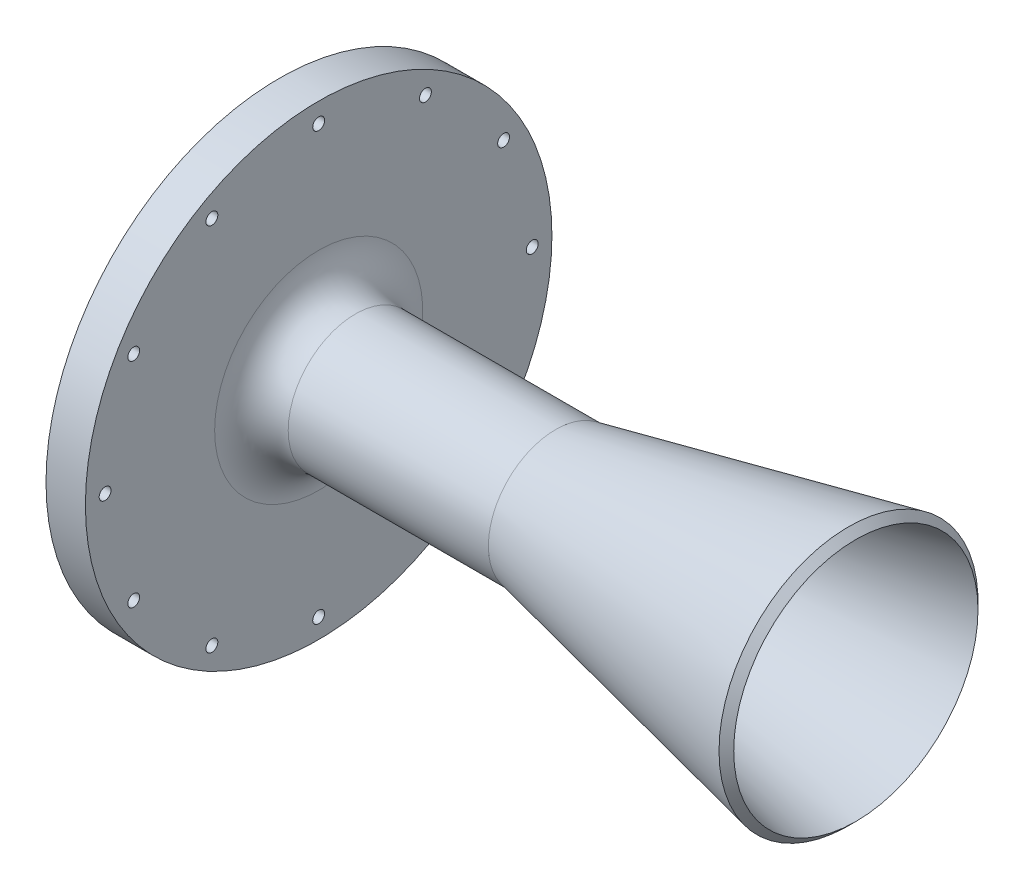
ISO-10303-21;
HEADER;
FILE_DESCRIPTION(('STEP AP214'),'2;1');
FILE_NAME('part.step','',(''),(''),'','','');
FILE_SCHEMA(('AUTOMOTIVE_DESIGN { 1 0 10303 214 1 1 1 1 }'));
ENDSEC;
DATA;
#1=APPLICATION_CONTEXT('core data for automotive mechanical design processes');
#2=APPLICATION_PROTOCOL_DEFINITION('international standard','automotive_design',2000,#1);
#3=PRODUCT_CONTEXT('',#1,'mechanical');
#4=PRODUCT('Part','Part','',(#3));
#5=PRODUCT_RELATED_PRODUCT_CATEGORY('part','',(#4));
#6=PRODUCT_DEFINITION_FORMATION('','',#4);
#7=PRODUCT_DEFINITION_CONTEXT('part definition',#1,'design');
#8=PRODUCT_DEFINITION('design','',#6,#7);
#9=PRODUCT_DEFINITION_SHAPE('','',#8);
#10=(LENGTH_UNIT() NAMED_UNIT(*) SI_UNIT(.MILLI.,.METRE.));
#11=(NAMED_UNIT(*) PLANE_ANGLE_UNIT() SI_UNIT($,.RADIAN.));
#12=(NAMED_UNIT(*) SI_UNIT($,.STERADIAN.) SOLID_ANGLE_UNIT());
#13=UNCERTAINTY_MEASURE_WITH_UNIT(LENGTH_MEASURE(1.E-05),#10,'distance_accuracy_value','');
#14=(GEOMETRIC_REPRESENTATION_CONTEXT(3) GLOBAL_UNCERTAINTY_ASSIGNED_CONTEXT((#13)) GLOBAL_UNIT_ASSIGNED_CONTEXT((#10,
#11,#12)) REPRESENTATION_CONTEXT('',''));
#15=CARTESIAN_POINT('',(0.,0.,0.));
#16=DIRECTION('',(0.,0.,1.));
#17=DIRECTION('',(1.,0.,0.));
#18=AXIS2_PLACEMENT_3D('',#15,#16,#17);
#19=CARTESIAN_POINT('',(0.,20.583496155902,0.));
#20=DIRECTION('',(1.,0.,0.));
#21=DIRECTION('',(0.,0.,-1.));
#22=AXIS2_PLACEMENT_3D('',#19,#20,#21);
#23=PLANE('',#22);
#24=CARTESIAN_POINT('',(0.,0.,0.));
#25=DIRECTION('',(1.,0.,0.));
#26=DIRECTION('',(0.,0.,-1.));
#27=AXIS2_PLACEMENT_3D('',#24,#25,#26);
#28=CIRCLE('',#27,38.1);
#29=CARTESIAN_POINT('',(0.,0.,-38.1));
#30=VERTEX_POINT('',#29);
#31=EDGE_CURVE('E182',#30,#30,#28,.T.);
#32=ORIENTED_EDGE('',*,*,#31,.T.);
#33=EDGE_LOOP('',(#32));
#34=FACE_BOUND('',#33,.T.);
#35=CARTESIAN_POINT('',(0.,-13.3616626129386,49.8664037450867));
#36=DIRECTION('',(-1.,0.,0.));
#37=DIRECTION('',(0.,0.,1.));
#38=AXIS2_PLACEMENT_3D('',#35,#36,#37);
#39=CIRCLE('',#38,2.38125);
#40=CARTESIAN_POINT('',(0.,-13.3616626129386,52.2476537450867));
#41=VERTEX_POINT('',#40);
#42=EDGE_CURVE('E73',#41,#41,#39,.T.);
#43=ORIENTED_EDGE('',*,*,#42,.F.);
#44=EDGE_LOOP('',(#43));
#45=FACE_BOUND('',#44,.T.);
#46=CARTESIAN_POINT('',(0.,13.3616626129382,-49.8664037450868));
#47=DIRECTION('',(-1.,0.,0.));
#48=DIRECTION('',(0.,0.,1.));
#49=AXIS2_PLACEMENT_3D('',#46,#47,#48);
#50=CIRCLE('',#49,2.38125);
#51=CARTESIAN_POINT('',(0.,13.3616626129382,-47.4851537450868));
#52=VERTEX_POINT('',#51);
#53=EDGE_CURVE('E72',#52,#52,#50,.T.);
#54=ORIENTED_EDGE('',*,*,#53,.F.);
#55=EDGE_LOOP('',(#54));
#56=FACE_BOUND('',#55,.T.);
#57=CARTESIAN_POINT('',(0.,-44.7089944830735,-25.81275));
#58=DIRECTION('',(-1.,0.,0.));
#59=DIRECTION('',(0.,0.,1.));
#60=AXIS2_PLACEMENT_3D('',#57,#58,#59);
#61=CIRCLE('',#60,1.43509999999999);
#62=CARTESIAN_POINT('',(0.,-44.7089944830735,-24.37765));
#63=VERTEX_POINT('',#62);
#64=EDGE_CURVE('E91',#63,#63,#61,.T.);
#65=ORIENTED_EDGE('',*,*,#64,.F.);
#66=EDGE_LOOP('',(#65));
#67=FACE_BOUND('',#66,.T.);
#68=CARTESIAN_POINT('',(0.,-25.81275,-44.7089944830735));
#69=DIRECTION('',(-1.,0.,0.));
#70=DIRECTION('',(0.,0.,1.));
#71=AXIS2_PLACEMENT_3D('',#68,#69,#70);
#72=CIRCLE('',#71,1.43509999999999);
#73=CARTESIAN_POINT('',(0.,-25.81275,-43.2738944830735));
#74=VERTEX_POINT('',#73);
#75=EDGE_CURVE('E97',#74,#74,#72,.T.);
#76=ORIENTED_EDGE('',*,*,#75,.F.);
#77=EDGE_LOOP('',(#76));
#78=FACE_BOUND('',#77,.T.);
#79=CARTESIAN_POINT('',(0.,0.,-51.6255));
#80=DIRECTION('',(-1.,0.,0.));
#81=DIRECTION('',(0.,0.,1.));
#82=AXIS2_PLACEMENT_3D('',#79,#80,#81);
#83=CIRCLE('',#82,1.43509999999999);
#84=CARTESIAN_POINT('',(0.,0.,-50.1904));
#85=VERTEX_POINT('',#84);
#86=EDGE_CURVE('E103',#85,#85,#83,.T.);
#87=ORIENTED_EDGE('',*,*,#86,.F.);
#88=EDGE_LOOP('',(#87));
#89=FACE_BOUND('',#88,.T.);
#90=CARTESIAN_POINT('',(0.,25.81275,-44.7089944830735));
#91=DIRECTION('',(-1.,0.,0.));
#92=DIRECTION('',(0.,0.,1.));
#93=AXIS2_PLACEMENT_3D('',#90,#91,#92);
#94=CIRCLE('',#93,1.43509999999999);
#95=CARTESIAN_POINT('',(0.,25.81275,-43.2738944830736));
#96=VERTEX_POINT('',#95);
#97=EDGE_CURVE('E109',#96,#96,#94,.T.);
#98=ORIENTED_EDGE('',*,*,#97,.F.);
#99=EDGE_LOOP('',(#98));
#100=FACE_BOUND('',#99,.T.);
#101=CARTESIAN_POINT('',(0.,44.7089944830735,-25.81275));
#102=DIRECTION('',(-1.,0.,0.));
#103=DIRECTION('',(0.,0.,1.));
#104=AXIS2_PLACEMENT_3D('',#101,#102,#103);
#105=CIRCLE('',#104,1.43509999999999);
#106=CARTESIAN_POINT('',(0.,44.7089944830735,-24.37765));
#107=VERTEX_POINT('',#106);
#108=EDGE_CURVE('E115',#107,#107,#105,.T.);
#109=ORIENTED_EDGE('',*,*,#108,.F.);
#110=EDGE_LOOP('',(#109));
#111=FACE_BOUND('',#110,.T.);
#112=CARTESIAN_POINT('',(0.,51.6255,0.));
#113=DIRECTION('',(-1.,0.,0.));
#114=DIRECTION('',(0.,0.,1.));
#115=AXIS2_PLACEMENT_3D('',#112,#113,#114);
#116=CIRCLE('',#115,1.43509999999999);
#117=CARTESIAN_POINT('',(0.,51.6255,1.43509999999999));
#118=VERTEX_POINT('',#117);
#119=EDGE_CURVE('E121',#118,#118,#116,.T.);
#120=ORIENTED_EDGE('',*,*,#119,.F.);
#121=EDGE_LOOP('',(#120));
#122=FACE_BOUND('',#121,.T.);
#123=CARTESIAN_POINT('',(0.,44.7089944830736,25.81275));
#124=DIRECTION('',(-1.,0.,0.));
#125=DIRECTION('',(0.,0.,1.));
#126=AXIS2_PLACEMENT_3D('',#123,#124,#125);
#127=CIRCLE('',#126,1.43509999999999);
#128=CARTESIAN_POINT('',(0.,44.7089944830736,27.24785));
#129=VERTEX_POINT('',#128);
#130=EDGE_CURVE('E127',#129,#129,#127,.T.);
#131=ORIENTED_EDGE('',*,*,#130,.F.);
#132=EDGE_LOOP('',(#131));
#133=FACE_BOUND('',#132,.T.);
#134=CARTESIAN_POINT('',(0.,25.81275,44.7089944830735));
#135=DIRECTION('',(-1.,0.,0.));
#136=DIRECTION('',(0.,0.,1.));
#137=AXIS2_PLACEMENT_3D('',#134,#135,#136);
#138=CIRCLE('',#137,1.43509999999999);
#139=CARTESIAN_POINT('',(0.,25.81275,46.1440944830735));
#140=VERTEX_POINT('',#139);
#141=EDGE_CURVE('E133',#140,#140,#138,.T.);
#142=ORIENTED_EDGE('',*,*,#141,.F.);
#143=EDGE_LOOP('',(#142));
#144=FACE_BOUND('',#143,.T.);
#145=CARTESIAN_POINT('',(0.,0.,51.6255));
#146=DIRECTION('',(-1.,0.,0.));
#147=DIRECTION('',(0.,0.,1.));
#148=AXIS2_PLACEMENT_3D('',#145,#146,#147);
#149=CIRCLE('',#148,1.43509999999999);
#150=CARTESIAN_POINT('',(0.,0.,53.0606));
#151=VERTEX_POINT('',#150);
#152=EDGE_CURVE('E139',#151,#151,#149,.T.);
#153=ORIENTED_EDGE('',*,*,#152,.F.);
#154=EDGE_LOOP('',(#153));
#155=FACE_BOUND('',#154,.T.);
#156=CARTESIAN_POINT('',(0.,-25.81275,44.7089944830736));
#157=DIRECTION('',(-1.,0.,0.));
#158=DIRECTION('',(0.,0.,1.));
#159=AXIS2_PLACEMENT_3D('',#156,#157,#158);
#160=CIRCLE('',#159,1.43509999999999);
#161=CARTESIAN_POINT('',(0.,-25.81275,46.1440944830736));
#162=VERTEX_POINT('',#161);
#163=EDGE_CURVE('E145',#162,#162,#160,.T.);
#164=ORIENTED_EDGE('',*,*,#163,.F.);
#165=EDGE_LOOP('',(#164));
#166=FACE_BOUND('',#165,.T.);
#167=CARTESIAN_POINT('',(0.,-44.7089944830735,25.81275));
#168=DIRECTION('',(-1.,0.,0.));
#169=DIRECTION('',(0.,0.,1.));
#170=AXIS2_PLACEMENT_3D('',#167,#168,#169);
#171=CIRCLE('',#170,1.43509999999999);
#172=CARTESIAN_POINT('',(0.,-44.7089944830735,27.24785));
#173=VERTEX_POINT('',#172);
#174=EDGE_CURVE('E151',#173,#173,#171,.T.);
#175=ORIENTED_EDGE('',*,*,#174,.F.);
#176=EDGE_LOOP('',(#175));
#177=FACE_BOUND('',#176,.T.);
#178=CARTESIAN_POINT('',(0.,0.,0.));
#179=DIRECTION('',(-1.,0.,0.));
#180=DIRECTION('',(0.,0.,1.));
#181=AXIS2_PLACEMENT_3D('',#178,#179,#180);
#182=CIRCLE('',#181,56.388);
#183=CARTESIAN_POINT('',(0.,0.,56.388));
#184=VERTEX_POINT('',#183);
#185=EDGE_CURVE('E163',#184,#184,#182,.T.);
#186=ORIENTED_EDGE('',*,*,#185,.T.);
#187=EDGE_LOOP('',(#186));
#188=FACE_BOUND('',#187,.T.);
#189=CARTESIAN_POINT('',(0.,-51.6255,0.));
#190=DIRECTION('',(-1.,0.,0.));
#191=DIRECTION('',(0.,0.,1.));
#192=AXIS2_PLACEMENT_3D('',#189,#190,#191);
#193=CIRCLE('',#192,1.43509999999999);
#194=CARTESIAN_POINT('',(0.,-51.6255,1.43509999999999));
#195=VERTEX_POINT('',#194);
#196=EDGE_CURVE('E85',#195,#195,#193,.T.);
#197=ORIENTED_EDGE('',*,*,#196,.F.);
#198=EDGE_LOOP('',(#197));
#199=FACE_BOUND('',#198,.T.);
#200=ADVANCED_FACE('F48',(#34,#45,#56,#67,#78,#89,#100,#111,#122,#133,#144,#155,#166,#177,#188,
#199),#23,.F.);
#201=CARTESIAN_POINT('',(60.325,0.,0.));
#202=DIRECTION('',(1.,0.,0.));
#203=DIRECTION('',(0.,0.,-1.));
#204=AXIS2_PLACEMENT_3D('',#201,#202,#203);
#205=CONICAL_SURFACE('',#204,12.7207818181818,0.20943951023932);
#206=CARTESIAN_POINT('',(139.384584692517,0.,0.));
#207=DIRECTION('',(1.,0.,0.));
#208=DIRECTION('',(0.,0.,-1.));
#209=AXIS2_PLACEMENT_3D('',#206,#207,#208);
#210=CIRCLE('',#209,29.5254153074831);
#211=CARTESIAN_POINT('',(139.384584692517,0.,-29.5254153074831));
#212=VERTEX_POINT('',#211);
#213=EDGE_CURVE('E13',#212,#212,#210,.T.);
#214=ORIENTED_EDGE('',*,*,#213,.T.);
#215=EDGE_LOOP('',(#214));
#216=FACE_BOUND('',#215,.T.);
#217=CARTESIAN_POINT('',(60.325,0.,0.));
#218=DIRECTION('',(-1.,0.,0.));
#219=DIRECTION('',(0.,0.,1.));
#220=AXIS2_PLACEMENT_3D('',#217,#218,#219);
#221=CIRCLE('',#220,12.7207818181818);
#222=CARTESIAN_POINT('',(60.325,0.,12.7207818181818));
#223=VERTEX_POINT('',#222);
#224=EDGE_CURVE('E172',#223,#223,#221,.T.);
#225=ORIENTED_EDGE('',*,*,#224,.T.);
#226=EDGE_LOOP('',(#225));
#227=FACE_BOUND('',#226,.T.);
#228=ADVANCED_FACE('F200',(#216,#227),#205,.F.);
#229=CARTESIAN_POINT('',(60.325,12.7207818181818,0.));
#230=DIRECTION('',(1.,0.,0.));
#231=DIRECTION('',(0.,0.,-1.));
#232=AXIS2_PLACEMENT_3D('',#229,#230,#231);
#233=PLANE('',#232);
#234=ORIENTED_EDGE('',*,*,#224,.F.);
#235=EDGE_LOOP('',(#234));
#236=FACE_BOUND('',#235,.T.);
#237=CARTESIAN_POINT('',(60.325,0.,0.));
#238=DIRECTION('',(-1.,0.,0.));
#239=DIRECTION('',(0.,0.,1.));
#240=AXIS2_PLACEMENT_3D('',#237,#238,#239);
#241=CIRCLE('',#240,14.351);
#242=CARTESIAN_POINT('',(60.325,0.,14.351));
#243=VERTEX_POINT('',#242);
#244=EDGE_CURVE('E169',#243,#243,#241,.T.);
#245=ORIENTED_EDGE('',*,*,#244,.T.);
#246=EDGE_LOOP('',(#245));
#247=FACE_BOUND('',#246,.T.);
#248=ADVANCED_FACE('F206',(#236,#247),#233,.F.);
#249=CARTESIAN_POINT('',(0.,0.,0.));
#250=DIRECTION('',(-1.,0.,0.));
#251=DIRECTION('',(0.,0.,1.));
#252=AXIS2_PLACEMENT_3D('',#249,#250,#251);
#253=CYLINDRICAL_SURFACE('',#252,14.351);
#254=ORIENTED_EDGE('',*,*,#244,.F.);
#255=EDGE_LOOP('',(#254));
#256=FACE_BOUND('',#255,.T.);
#257=CARTESIAN_POINT('',(10.795,0.,0.));
#258=DIRECTION('',(-1.,0.,0.));
#259=DIRECTION('',(0.,0.,1.));
#260=AXIS2_PLACEMENT_3D('',#257,#258,#259);
#261=CIRCLE('',#260,14.351);
#262=CARTESIAN_POINT('',(10.795,0.,14.351));
#263=VERTEX_POINT('',#262);
#264=EDGE_CURVE('E166',#263,#263,#261,.T.);
#265=ORIENTED_EDGE('',*,*,#264,.T.);
#266=EDGE_LOOP('',(#265));
#267=FACE_BOUND('',#266,.T.);
#268=ADVANCED_FACE('F218',(#256,#267),#253,.F.);
#269=CARTESIAN_POINT('',(0.,0.,0.));
#270=DIRECTION('',(-1.,0.,0.));
#271=DIRECTION('',(0.,0.,1.));
#272=AXIS2_PLACEMENT_3D('',#269,#270,#271);
#273=CONICAL_SURFACE('',#272,20.583496155902,0.5235987755983);
#274=CARTESIAN_POINT('',(1.61402236879913,0.,0.));
#275=DIRECTION('',(-1.,0.,0.));
#276=DIRECTION('',(0.,0.,1.));
#277=AXIS2_PLACEMENT_3D('',#274,#275,#276);
#278=CIRCLE('',#277,19.6516399067978);
#279=CARTESIAN_POINT('',(1.61402236879913,0.,19.6516399067978));
#280=VERTEX_POINT('',#279);
#281=EDGE_CURVE('E79',#280,#280,#278,.T.);
#282=ORIENTED_EDGE('',*,*,#281,.T.);
#283=EDGE_LOOP('',(#282));
#284=FACE_BOUND('',#283,.T.);
#285=ORIENTED_EDGE('',*,*,#264,.F.);
#286=EDGE_LOOP('',(#285));
#287=FACE_BOUND('',#286,.T.);
#288=ADVANCED_FACE('F215',(#284,#287),#273,.F.);
#289=CARTESIAN_POINT('',(0.,0.,0.));
#290=DIRECTION('',(-1.,0.,0.));
#291=DIRECTION('',(0.,0.,1.));
#292=AXIS2_PLACEMENT_3D('',#289,#290,#291);
#293=CYLINDRICAL_SURFACE('',#292,56.388);
#294=ORIENTED_EDGE('',*,*,#185,.F.);
#295=EDGE_LOOP('',(#294));
#296=FACE_BOUND('',#295,.T.);
#297=CARTESIAN_POINT('',(9.525,0.,0.));
#298=DIRECTION('',(-1.,0.,0.));
#299=DIRECTION('',(0.,0.,1.));
#300=AXIS2_PLACEMENT_3D('',#297,#298,#299);
#301=CIRCLE('',#300,56.388);
#302=CARTESIAN_POINT('',(9.525,0.,56.388));
#303=VERTEX_POINT('',#302);
#304=EDGE_CURVE('E160',#303,#303,#301,.T.);
#305=ORIENTED_EDGE('',*,*,#304,.T.);
#306=EDGE_LOOP('',(#305));
#307=FACE_BOUND('',#306,.T.);
#308=ADVANCED_FACE('F213',(#296,#307),#293,.T.);
#309=CARTESIAN_POINT('',(9.525,56.388,0.));
#310=DIRECTION('',(-1.,0.,0.));
#311=DIRECTION('',(0.,0.,1.));
#312=AXIS2_PLACEMENT_3D('',#309,#310,#311);
#313=PLANE('',#312);
#314=CARTESIAN_POINT('',(9.525,0.,0.));
#315=DIRECTION('',(-1.,0.,0.));
#316=DIRECTION('',(0.,0.,1.));
#317=AXIS2_PLACEMENT_3D('',#314,#315,#316);
#318=CIRCLE('',#317,25.146);
#319=CARTESIAN_POINT('',(9.525,0.,25.146));
#320=VERTEX_POINT('',#319);
#321=EDGE_CURVE('E175',#320,#320,#318,.T.);
#322=ORIENTED_EDGE('',*,*,#321,.T.);
#323=EDGE_LOOP('',(#322));
#324=FACE_BOUND('',#323,.T.);
#325=CARTESIAN_POINT('',(9.525,-51.6255,0.));
#326=DIRECTION('',(-1.,0.,0.));
#327=DIRECTION('',(0.,0.,1.));
#328=AXIS2_PLACEMENT_3D('',#325,#326,#327);
#329=CIRCLE('',#328,1.43509999999999);
#330=CARTESIAN_POINT('',(9.525,-51.6255,1.43509999999999));
#331=VERTEX_POINT('',#330);
#332=EDGE_CURVE('E88',#331,#331,#329,.T.);
#333=ORIENTED_EDGE('',*,*,#332,.T.);
#334=EDGE_LOOP('',(#333));
#335=FACE_BOUND('',#334,.T.);
#336=CARTESIAN_POINT('',(9.525,-44.7089944830735,-25.81275));
#337=DIRECTION('',(-1.,0.,0.));
#338=DIRECTION('',(0.,0.,1.));
#339=AXIS2_PLACEMENT_3D('',#336,#337,#338);
#340=CIRCLE('',#339,1.43509999999999);
#341=CARTESIAN_POINT('',(9.525,-44.7089944830735,-24.37765));
#342=VERTEX_POINT('',#341);
#343=EDGE_CURVE('E94',#342,#342,#340,.T.);
#344=ORIENTED_EDGE('',*,*,#343,.T.);
#345=EDGE_LOOP('',(#344));
#346=FACE_BOUND('',#345,.T.);
#347=CARTESIAN_POINT('',(9.525,-25.81275,-44.7089944830735));
#348=DIRECTION('',(-1.,0.,0.));
#349=DIRECTION('',(0.,0.,1.));
#350=AXIS2_PLACEMENT_3D('',#347,#348,#349);
#351=CIRCLE('',#350,1.43509999999999);
#352=CARTESIAN_POINT('',(9.525,-25.81275,-43.2738944830735));
#353=VERTEX_POINT('',#352);
#354=EDGE_CURVE('E100',#353,#353,#351,.T.);
#355=ORIENTED_EDGE('',*,*,#354,.T.);
#356=EDGE_LOOP('',(#355));
#357=FACE_BOUND('',#356,.T.);
#358=CARTESIAN_POINT('',(9.525,0.,-51.6255));
#359=DIRECTION('',(-1.,0.,0.));
#360=DIRECTION('',(0.,0.,1.));
#361=AXIS2_PLACEMENT_3D('',#358,#359,#360);
#362=CIRCLE('',#361,1.43509999999999);
#363=CARTESIAN_POINT('',(9.525,0.,-50.1904));
#364=VERTEX_POINT('',#363);
#365=EDGE_CURVE('E106',#364,#364,#362,.T.);
#366=ORIENTED_EDGE('',*,*,#365,.T.);
#367=EDGE_LOOP('',(#366));
#368=FACE_BOUND('',#367,.T.);
#369=CARTESIAN_POINT('',(9.525,25.81275,-44.7089944830735));
#370=DIRECTION('',(-1.,0.,0.));
#371=DIRECTION('',(0.,0.,1.));
#372=AXIS2_PLACEMENT_3D('',#369,#370,#371);
#373=CIRCLE('',#372,1.43509999999999);
#374=CARTESIAN_POINT('',(9.525,25.81275,-43.2738944830736));
#375=VERTEX_POINT('',#374);
#376=EDGE_CURVE('E112',#375,#375,#373,.T.);
#377=ORIENTED_EDGE('',*,*,#376,.T.);
#378=EDGE_LOOP('',(#377));
#379=FACE_BOUND('',#378,.T.);
#380=CARTESIAN_POINT('',(9.525,44.7089944830735,-25.81275));
#381=DIRECTION('',(-1.,0.,0.));
#382=DIRECTION('',(0.,0.,1.));
#383=AXIS2_PLACEMENT_3D('',#380,#381,#382);
#384=CIRCLE('',#383,1.43509999999999);
#385=CARTESIAN_POINT('',(9.525,44.7089944830735,-24.37765));
#386=VERTEX_POINT('',#385);
#387=EDGE_CURVE('E118',#386,#386,#384,.T.);
#388=ORIENTED_EDGE('',*,*,#387,.T.);
#389=EDGE_LOOP('',(#388));
#390=FACE_BOUND('',#389,.T.);
#391=CARTESIAN_POINT('',(9.525,51.6255,0.));
#392=DIRECTION('',(-1.,0.,0.));
#393=DIRECTION('',(0.,0.,1.));
#394=AXIS2_PLACEMENT_3D('',#391,#392,#393);
#395=CIRCLE('',#394,1.43509999999999);
#396=CARTESIAN_POINT('',(9.525,51.6255,1.43509999999999));
#397=VERTEX_POINT('',#396);
#398=EDGE_CURVE('E124',#397,#397,#395,.T.);
#399=ORIENTED_EDGE('',*,*,#398,.T.);
#400=EDGE_LOOP('',(#399));
#401=FACE_BOUND('',#400,.T.);
#402=CARTESIAN_POINT('',(9.525,44.7089944830736,25.81275));
#403=DIRECTION('',(-1.,0.,0.));
#404=DIRECTION('',(0.,0.,1.));
#405=AXIS2_PLACEMENT_3D('',#402,#403,#404);
#406=CIRCLE('',#405,1.43509999999999);
#407=CARTESIAN_POINT('',(9.525,44.7089944830736,27.24785));
#408=VERTEX_POINT('',#407);
#409=EDGE_CURVE('E130',#408,#408,#406,.T.);
#410=ORIENTED_EDGE('',*,*,#409,.T.);
#411=EDGE_LOOP('',(#410));
#412=FACE_BOUND('',#411,.T.);
#413=CARTESIAN_POINT('',(9.525,25.81275,44.7089944830735));
#414=DIRECTION('',(-1.,0.,0.));
#415=DIRECTION('',(0.,0.,1.));
#416=AXIS2_PLACEMENT_3D('',#413,#414,#415);
#417=CIRCLE('',#416,1.43509999999999);
#418=CARTESIAN_POINT('',(9.525,25.81275,46.1440944830735));
#419=VERTEX_POINT('',#418);
#420=EDGE_CURVE('E136',#419,#419,#417,.T.);
#421=ORIENTED_EDGE('',*,*,#420,.T.);
#422=EDGE_LOOP('',(#421));
#423=FACE_BOUND('',#422,.T.);
#424=CARTESIAN_POINT('',(9.525,0.,51.6255));
#425=DIRECTION('',(-1.,0.,0.));
#426=DIRECTION('',(0.,0.,1.));
#427=AXIS2_PLACEMENT_3D('',#424,#425,#426);
#428=CIRCLE('',#427,1.43509999999999);
#429=CARTESIAN_POINT('',(9.525,0.,53.0606));
#430=VERTEX_POINT('',#429);
#431=EDGE_CURVE('E142',#430,#430,#428,.T.);
#432=ORIENTED_EDGE('',*,*,#431,.T.);
#433=EDGE_LOOP('',(#432));
#434=FACE_BOUND('',#433,.T.);
#435=CARTESIAN_POINT('',(9.525,-25.81275,44.7089944830736));
#436=DIRECTION('',(-1.,0.,0.));
#437=DIRECTION('',(0.,0.,1.));
#438=AXIS2_PLACEMENT_3D('',#435,#436,#437);
#439=CIRCLE('',#438,1.43509999999999);
#440=CARTESIAN_POINT('',(9.525,-25.81275,46.1440944830736));
#441=VERTEX_POINT('',#440);
#442=EDGE_CURVE('E148',#441,#441,#439,.T.);
#443=ORIENTED_EDGE('',*,*,#442,.T.);
#444=EDGE_LOOP('',(#443));
#445=FACE_BOUND('',#444,.T.);
#446=CARTESIAN_POINT('',(9.525,-44.7089944830735,25.81275));
#447=DIRECTION('',(-1.,0.,0.));
#448=DIRECTION('',(0.,0.,1.));
#449=AXIS2_PLACEMENT_3D('',#446,#447,#448);
#450=CIRCLE('',#449,1.43509999999999);
#451=CARTESIAN_POINT('',(9.525,-44.7089944830735,27.24785));
#452=VERTEX_POINT('',#451);
#453=EDGE_CURVE('E154',#452,#452,#450,.T.);
#454=ORIENTED_EDGE('',*,*,#453,.T.);
#455=EDGE_LOOP('',(#454));
#456=FACE_BOUND('',#455,.T.);
#457=ORIENTED_EDGE('',*,*,#304,.F.);
#458=EDGE_LOOP('',(#457));
#459=FACE_BOUND('',#458,.T.);
#460=ADVANCED_FACE('F235',(#324,#335,#346,#357,#368,#379,#390,#401,#412,#423,#434,#445,#456,
#459),#313,.F.);
#461=CARTESIAN_POINT('',(0.,0.,0.));
#462=DIRECTION('',(-1.,0.,0.));
#463=DIRECTION('',(0.,0.,1.));
#464=AXIS2_PLACEMENT_3D('',#461,#462,#463);
#465=CYLINDRICAL_SURFACE('',#464,16.256);
#466=CARTESIAN_POINT('',(18.415,0.,0.));
#467=DIRECTION('',(-1.,0.,0.));
#468=DIRECTION('',(0.,0.,1.));
#469=AXIS2_PLACEMENT_3D('',#466,#467,#468);
#470=CIRCLE('',#469,16.256);
#471=CARTESIAN_POINT('',(18.415,0.,16.256));
#472=VERTEX_POINT('',#471);
#473=EDGE_CURVE('E178',#472,#472,#470,.F.);
#474=ORIENTED_EDGE('',*,*,#473,.T.);
#475=EDGE_LOOP('',(#474));
#476=FACE_BOUND('',#475,.T.);
#477=CARTESIAN_POINT('',(66.806461083741,0.,0.));
#478=DIRECTION('',(-1.,0.,0.));
#479=DIRECTION('',(0.,0.,1.));
#480=AXIS2_PLACEMENT_3D('',#477,#478,#479);
#481=CIRCLE('',#480,16.256);
#482=CARTESIAN_POINT('',(66.806461083741,0.,16.256));
#483=VERTEX_POINT('',#482);
#484=EDGE_CURVE('E157',#483,#483,#481,.T.);
#485=ORIENTED_EDGE('',*,*,#484,.T.);
#486=EDGE_LOOP('',(#485));
#487=FACE_BOUND('',#486,.T.);
#488=ADVANCED_FACE('F238',(#476,#487),#465,.T.);
#489=CARTESIAN_POINT('',(139.7,0.,0.));
#490=DIRECTION('',(1.,0.,0.));
#491=DIRECTION('',(0.,0.,-1.));
#492=AXIS2_PLACEMENT_3D('',#489,#490,#491);
#493=CONICAL_SURFACE('',#492,31.75,0.20943951023932);
#494=CARTESIAN_POINT('',(137.605252356639,0.,0.));
#495=DIRECTION('',(-1.,0.,0.));
#496=DIRECTION('',(0.,0.,1.));
#497=AXIS2_PLACEMENT_3D('',#494,#495,#496);
#498=CIRCLE('',#497,31.3047476433608);
#499=CARTESIAN_POINT('',(137.605252356639,0.,31.3047476433608));
#500=VERTEX_POINT('',#499);
#501=EDGE_CURVE('E56',#500,#500,#498,.T.);
#502=ORIENTED_EDGE('',*,*,#501,.T.);
#503=EDGE_LOOP('',(#502));
#504=FACE_BOUND('',#503,.T.);
#505=ORIENTED_EDGE('',*,*,#484,.F.);
#506=EDGE_LOOP('',(#505));
#507=FACE_BOUND('',#506,.T.);
#508=ADVANCED_FACE('F186',(#504,#507),#493,.T.);
#509=CARTESIAN_POINT('',(0.,-44.7089944830735,25.81275));
#510=DIRECTION('',(-1.,0.,0.));
#511=DIRECTION('',(0.,0.,1.));
#512=AXIS2_PLACEMENT_3D('',#509,#510,#511);
#513=CYLINDRICAL_SURFACE('',#512,1.43509999999999);
#514=ORIENTED_EDGE('',*,*,#453,.F.);
#515=EDGE_LOOP('',(#514));
#516=FACE_BOUND('',#515,.T.);
#517=ORIENTED_EDGE('',*,*,#174,.T.);
#518=EDGE_LOOP('',(#517));
#519=FACE_BOUND('',#518,.T.);
#520=ADVANCED_FACE('F324',(#516,#519),#513,.F.);
#521=CARTESIAN_POINT('',(0.,-25.81275,44.7089944830736));
#522=DIRECTION('',(-1.,0.,0.));
#523=DIRECTION('',(0.,0.,1.));
#524=AXIS2_PLACEMENT_3D('',#521,#522,#523);
#525=CYLINDRICAL_SURFACE('',#524,1.43509999999999);
#526=ORIENTED_EDGE('',*,*,#442,.F.);
#527=EDGE_LOOP('',(#526));
#528=FACE_BOUND('',#527,.T.);
#529=ORIENTED_EDGE('',*,*,#163,.T.);
#530=EDGE_LOOP('',(#529));
#531=FACE_BOUND('',#530,.T.);
#532=ADVANCED_FACE('F320',(#528,#531),#525,.F.);
#533=CARTESIAN_POINT('',(0.,0.,51.6255));
#534=DIRECTION('',(-1.,0.,0.));
#535=DIRECTION('',(0.,0.,1.));
#536=AXIS2_PLACEMENT_3D('',#533,#534,#535);
#537=CYLINDRICAL_SURFACE('',#536,1.43509999999999);
#538=ORIENTED_EDGE('',*,*,#431,.F.);
#539=EDGE_LOOP('',(#538));
#540=FACE_BOUND('',#539,.T.);
#541=ORIENTED_EDGE('',*,*,#152,.T.);
#542=EDGE_LOOP('',(#541));
#543=FACE_BOUND('',#542,.T.);
#544=ADVANCED_FACE('F316',(#540,#543),#537,.F.);
#545=CARTESIAN_POINT('',(0.,25.81275,44.7089944830735));
#546=DIRECTION('',(-1.,0.,0.));
#547=DIRECTION('',(0.,0.,1.));
#548=AXIS2_PLACEMENT_3D('',#545,#546,#547);
#549=CYLINDRICAL_SURFACE('',#548,1.43509999999999);
#550=ORIENTED_EDGE('',*,*,#420,.F.);
#551=EDGE_LOOP('',(#550));
#552=FACE_BOUND('',#551,.T.);
#553=ORIENTED_EDGE('',*,*,#141,.T.);
#554=EDGE_LOOP('',(#553));
#555=FACE_BOUND('',#554,.T.);
#556=ADVANCED_FACE('F312',(#552,#555),#549,.F.);
#557=CARTESIAN_POINT('',(0.,44.7089944830736,25.81275));
#558=DIRECTION('',(-1.,0.,0.));
#559=DIRECTION('',(0.,0.,1.));
#560=AXIS2_PLACEMENT_3D('',#557,#558,#559);
#561=CYLINDRICAL_SURFACE('',#560,1.43509999999999);
#562=ORIENTED_EDGE('',*,*,#409,.F.);
#563=EDGE_LOOP('',(#562));
#564=FACE_BOUND('',#563,.T.);
#565=ORIENTED_EDGE('',*,*,#130,.T.);
#566=EDGE_LOOP('',(#565));
#567=FACE_BOUND('',#566,.T.);
#568=ADVANCED_FACE('F308',(#564,#567),#561,.F.);
#569=CARTESIAN_POINT('',(0.,51.6255,0.));
#570=DIRECTION('',(-1.,0.,0.));
#571=DIRECTION('',(0.,0.,1.));
#572=AXIS2_PLACEMENT_3D('',#569,#570,#571);
#573=CYLINDRICAL_SURFACE('',#572,1.43509999999999);
#574=ORIENTED_EDGE('',*,*,#398,.F.);
#575=EDGE_LOOP('',(#574));
#576=FACE_BOUND('',#575,.T.);
#577=ORIENTED_EDGE('',*,*,#119,.T.);
#578=EDGE_LOOP('',(#577));
#579=FACE_BOUND('',#578,.T.);
#580=ADVANCED_FACE('F304',(#576,#579),#573,.F.);
#581=CARTESIAN_POINT('',(0.,44.7089944830735,-25.81275));
#582=DIRECTION('',(-1.,0.,0.));
#583=DIRECTION('',(0.,0.,1.));
#584=AXIS2_PLACEMENT_3D('',#581,#582,#583);
#585=CYLINDRICAL_SURFACE('',#584,1.43509999999999);
#586=ORIENTED_EDGE('',*,*,#387,.F.);
#587=EDGE_LOOP('',(#586));
#588=FACE_BOUND('',#587,.T.);
#589=ORIENTED_EDGE('',*,*,#108,.T.);
#590=EDGE_LOOP('',(#589));
#591=FACE_BOUND('',#590,.T.);
#592=ADVANCED_FACE('F300',(#588,#591),#585,.F.);
#593=CARTESIAN_POINT('',(0.,25.81275,-44.7089944830735));
#594=DIRECTION('',(-1.,0.,0.));
#595=DIRECTION('',(0.,0.,1.));
#596=AXIS2_PLACEMENT_3D('',#593,#594,#595);
#597=CYLINDRICAL_SURFACE('',#596,1.43509999999999);
#598=ORIENTED_EDGE('',*,*,#376,.F.);
#599=EDGE_LOOP('',(#598));
#600=FACE_BOUND('',#599,.T.);
#601=ORIENTED_EDGE('',*,*,#97,.T.);
#602=EDGE_LOOP('',(#601));
#603=FACE_BOUND('',#602,.T.);
#604=ADVANCED_FACE('F296',(#600,#603),#597,.F.);
#605=CARTESIAN_POINT('',(0.,0.,-51.6255));
#606=DIRECTION('',(-1.,0.,0.));
#607=DIRECTION('',(0.,0.,1.));
#608=AXIS2_PLACEMENT_3D('',#605,#606,#607);
#609=CYLINDRICAL_SURFACE('',#608,1.43509999999999);
#610=ORIENTED_EDGE('',*,*,#365,.F.);
#611=EDGE_LOOP('',(#610));
#612=FACE_BOUND('',#611,.T.);
#613=ORIENTED_EDGE('',*,*,#86,.T.);
#614=EDGE_LOOP('',(#613));
#615=FACE_BOUND('',#614,.T.);
#616=ADVANCED_FACE('F292',(#612,#615),#609,.F.);
#617=CARTESIAN_POINT('',(0.,-25.81275,-44.7089944830735));
#618=DIRECTION('',(-1.,0.,0.));
#619=DIRECTION('',(0.,0.,1.));
#620=AXIS2_PLACEMENT_3D('',#617,#618,#619);
#621=CYLINDRICAL_SURFACE('',#620,1.43509999999999);
#622=ORIENTED_EDGE('',*,*,#354,.F.);
#623=EDGE_LOOP('',(#622));
#624=FACE_BOUND('',#623,.T.);
#625=ORIENTED_EDGE('',*,*,#75,.T.);
#626=EDGE_LOOP('',(#625));
#627=FACE_BOUND('',#626,.T.);
#628=ADVANCED_FACE('F285',(#624,#627),#621,.F.);
#629=CARTESIAN_POINT('',(0.,-44.7089944830735,-25.81275));
#630=DIRECTION('',(-1.,0.,0.));
#631=DIRECTION('',(0.,0.,1.));
#632=AXIS2_PLACEMENT_3D('',#629,#630,#631);
#633=CYLINDRICAL_SURFACE('',#632,1.43509999999999);
#634=ORIENTED_EDGE('',*,*,#343,.F.);
#635=EDGE_LOOP('',(#634));
#636=FACE_BOUND('',#635,.T.);
#637=ORIENTED_EDGE('',*,*,#64,.T.);
#638=EDGE_LOOP('',(#637));
#639=FACE_BOUND('',#638,.T.);
#640=ADVANCED_FACE('F277',(#636,#639),#633,.F.);
#641=CARTESIAN_POINT('',(0.,-51.6255,0.));
#642=DIRECTION('',(-1.,0.,0.));
#643=DIRECTION('',(0.,0.,1.));
#644=AXIS2_PLACEMENT_3D('',#641,#642,#643);
#645=CYLINDRICAL_SURFACE('',#644,1.43509999999999);
#646=ORIENTED_EDGE('',*,*,#332,.F.);
#647=EDGE_LOOP('',(#646));
#648=FACE_BOUND('',#647,.T.);
#649=ORIENTED_EDGE('',*,*,#196,.T.);
#650=EDGE_LOOP('',(#649));
#651=FACE_BOUND('',#650,.T.);
#652=ADVANCED_FACE('F274',(#648,#651),#645,.F.);
#653=CARTESIAN_POINT('',(6.35,13.3616626129382,-49.8664037450868));
#654=DIRECTION('',(-1.,0.,0.));
#655=DIRECTION('',(0.,0.,1.));
#656=AXIS2_PLACEMENT_3D('',#653,#654,#655);
#657=CONICAL_SURFACE('',#656,2.38124999999999,1.02974425867665);
#658=CARTESIAN_POINT('',(7.78079934905938,13.3616626129382,-49.8664037450868));
#659=VERTEX_POINT('',#658);
#660=VERTEX_LOOP('',#659);
#661=FACE_BOUND('',#660,.T.);
#662=CARTESIAN_POINT('',(6.35,13.3616626129382,-49.8664037450868));
#663=DIRECTION('',(-1.,0.,0.));
#664=DIRECTION('',(0.,0.,1.));
#665=AXIS2_PLACEMENT_3D('',#662,#663,#664);
#666=CIRCLE('',#665,2.38124999999999);
#667=CARTESIAN_POINT('',(6.35,13.3616626129382,-47.4851537450868));
#668=VERTEX_POINT('',#667);
#669=EDGE_CURVE('E76',#668,#668,#666,.T.);
#670=ORIENTED_EDGE('',*,*,#669,.T.);
#671=EDGE_LOOP('',(#670));
#672=FACE_BOUND('',#671,.T.);
#673=ADVANCED_FACE('F276',(#661,#672),#657,.F.);
#674=CARTESIAN_POINT('',(0.,13.3616626129382,-49.8664037450868));
#675=DIRECTION('',(-1.,0.,0.));
#676=DIRECTION('',(0.,0.,1.));
#677=AXIS2_PLACEMENT_3D('',#674,#675,#676);
#678=CYLINDRICAL_SURFACE('',#677,2.38125);
#679=ORIENTED_EDGE('',*,*,#669,.F.);
#680=EDGE_LOOP('',(#679));
#681=FACE_BOUND('',#680,.T.);
#682=ORIENTED_EDGE('',*,*,#53,.T.);
#683=EDGE_LOOP('',(#682));
#684=FACE_BOUND('',#683,.T.);
#685=ADVANCED_FACE('F66',(#681,#684),#678,.F.);
#686=CARTESIAN_POINT('',(6.35,-13.3616626129386,49.8664037450867));
#687=DIRECTION('',(-1.,0.,0.));
#688=DIRECTION('',(0.,0.,1.));
#689=AXIS2_PLACEMENT_3D('',#686,#687,#688);
#690=CONICAL_SURFACE('',#689,2.38125,1.02974425867665);
#691=CARTESIAN_POINT('',(7.78079934905938,-13.3616626129386,49.8664037450867));
#692=VERTEX_POINT('',#691);
#693=VERTEX_LOOP('',#692);
#694=FACE_BOUND('',#693,.T.);
#695=CARTESIAN_POINT('',(6.35,-13.3616626129386,49.8664037450867));
#696=DIRECTION('',(-1.,0.,0.));
#697=DIRECTION('',(0.,0.,1.));
#698=AXIS2_PLACEMENT_3D('',#695,#696,#697);
#699=CIRCLE('',#698,2.38125);
#700=CARTESIAN_POINT('',(6.35,-13.3616626129386,52.2476537450867));
#701=VERTEX_POINT('',#700);
#702=EDGE_CURVE('E70',#701,#701,#699,.T.);
#703=ORIENTED_EDGE('',*,*,#702,.T.);
#704=EDGE_LOOP('',(#703));
#705=FACE_BOUND('',#704,.T.);
#706=ADVANCED_FACE('F62',(#694,#705),#690,.F.);
#707=CARTESIAN_POINT('',(0.,-13.3616626129386,49.8664037450867));
#708=DIRECTION('',(-1.,0.,0.));
#709=DIRECTION('',(0.,0.,1.));
#710=AXIS2_PLACEMENT_3D('',#707,#708,#709);
#711=CYLINDRICAL_SURFACE('',#710,2.38125);
#712=ORIENTED_EDGE('',*,*,#702,.F.);
#713=EDGE_LOOP('',(#712));
#714=FACE_BOUND('',#713,.T.);
#715=ORIENTED_EDGE('',*,*,#42,.T.);
#716=EDGE_LOOP('',(#715));
#717=FACE_BOUND('',#716,.T.);
#718=ADVANCED_FACE('F65',(#714,#717),#711,.F.);
#719=CARTESIAN_POINT('',(18.415,0.,0.));
#720=DIRECTION('',(-1.,0.,0.));
#721=DIRECTION('',(0.,0.,1.));
#722=AXIS2_PLACEMENT_3D('',#719,#720,#721);
#723=TOROIDAL_SURFACE('',#722,25.146,8.89);
#724=ORIENTED_EDGE('',*,*,#473,.F.);
#725=EDGE_LOOP('',(#724));
#726=FACE_BOUND('',#725,.T.);
#727=ORIENTED_EDGE('',*,*,#321,.F.);
#728=EDGE_LOOP('',(#727));
#729=FACE_BOUND('',#728,.T.);
#730=ADVANCED_FACE('F195',(#726,#729),#723,.F.);
#731=CARTESIAN_POINT('',(3.33331808033745,0.,0.));
#732=DIRECTION('',(-1.,0.,0.));
#733=DIRECTION('',(0.,0.,1.));
#734=AXIS2_PLACEMENT_3D('',#731,#732,#733);
#735=CONICAL_SURFACE('',#734,0.,1.48352986419519);
#736=ORIENTED_EDGE('',*,*,#31,.F.);
#737=EDGE_LOOP('',(#736));
#738=FACE_BOUND('',#737,.T.);
#739=ORIENTED_EDGE('',*,*,#281,.F.);
#740=EDGE_LOOP('',(#739));
#741=FACE_BOUND('',#740,.T.);
#742=ADVANCED_FACE('F190',(#738,#741),#735,.F.);
#743=CARTESIAN_POINT('',(137.605252356639,0.,0.));
#744=DIRECTION('',(-1.,0.,0.));
#745=DIRECTION('',(0.,0.,1.));
#746=AXIS2_PLACEMENT_3D('',#743,#744,#745);
#747=CONICAL_SURFACE('',#746,31.3047476433608,0.78539816339744);
#748=ORIENTED_EDGE('',*,*,#213,.F.);
#749=EDGE_LOOP('',(#748));
#750=FACE_BOUND('',#749,.T.);
#751=ORIENTED_EDGE('',*,*,#501,.F.);
#752=EDGE_LOOP('',(#751));
#753=FACE_BOUND('',#752,.T.);
#754=ADVANCED_FACE('F50',(#750,#753),#747,.T.);
#755=CLOSED_SHELL('',(#200,#228,#248,#268,#288,#308,#460,#488,#508,#520,#532,#544,#556,#568,
#580,#592,#604,#616,#628,#640,#652,#673,#685,#706,#718,#730,#742,#754));
#756=MANIFOLD_SOLID_BREP('B2',#755);
#757=ADVANCED_BREP_SHAPE_REPRESENTATION('',(#18,#756),#14);
#758=SHAPE_DEFINITION_REPRESENTATION(#9,#757);
ENDSEC;
END-ISO-10303-21;
